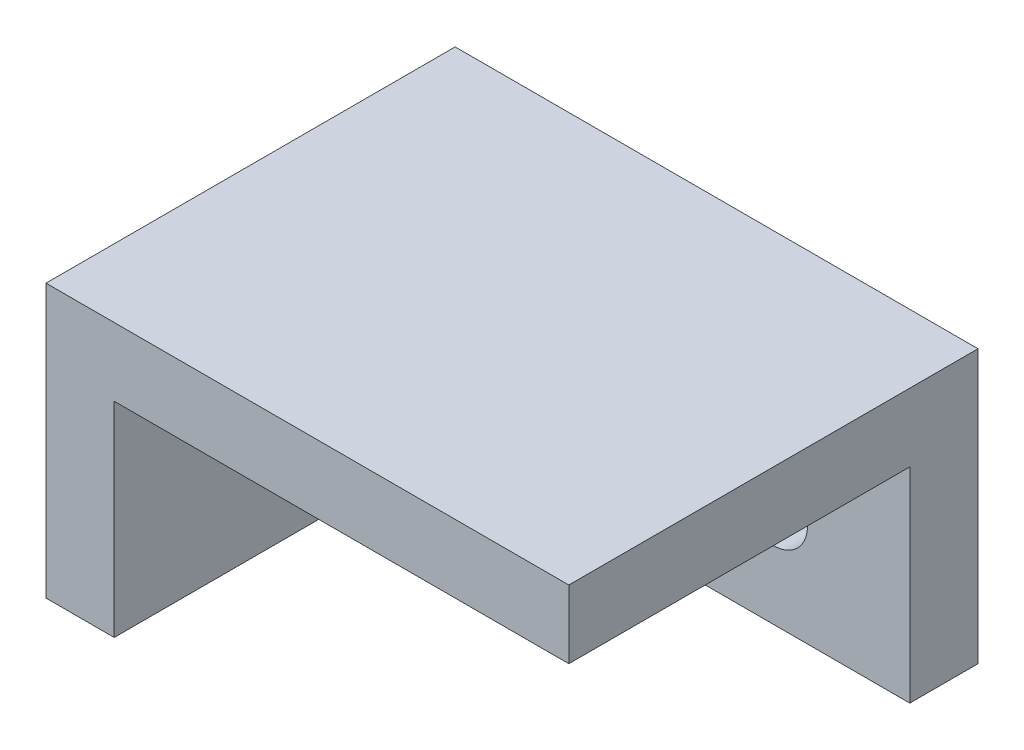
ISO-10303-21;
HEADER;
FILE_DESCRIPTION(('STEP AP214'),'2;1');
FILE_NAME('part.step','',(''),(''),'','','');
FILE_SCHEMA(('AUTOMOTIVE_DESIGN { 1 0 10303 214 1 1 1 1 }'));
ENDSEC;
DATA;
#1=APPLICATION_CONTEXT('core data for automotive mechanical design processes');
#2=APPLICATION_PROTOCOL_DEFINITION('international standard','automotive_design',2000,#1);
#3=PRODUCT_CONTEXT('',#1,'mechanical');
#4=PRODUCT('Part','Part','',(#3));
#5=PRODUCT_RELATED_PRODUCT_CATEGORY('part','',(#4));
#6=PRODUCT_DEFINITION_FORMATION('','',#4);
#7=PRODUCT_DEFINITION_CONTEXT('part definition',#1,'design');
#8=PRODUCT_DEFINITION('design','',#6,#7);
#9=PRODUCT_DEFINITION_SHAPE('','',#8);
#10=(LENGTH_UNIT() NAMED_UNIT(*) SI_UNIT(.MILLI.,.METRE.));
#11=(NAMED_UNIT(*) PLANE_ANGLE_UNIT() SI_UNIT($,.RADIAN.));
#12=(NAMED_UNIT(*) SI_UNIT($,.STERADIAN.) SOLID_ANGLE_UNIT());
#13=UNCERTAINTY_MEASURE_WITH_UNIT(LENGTH_MEASURE(1.E-05),#10,'distance_accuracy_value','');
#14=(GEOMETRIC_REPRESENTATION_CONTEXT(3) GLOBAL_UNCERTAINTY_ASSIGNED_CONTEXT((#13)) GLOBAL_UNIT_ASSIGNED_CONTEXT((#10,
#11,#12)) REPRESENTATION_CONTEXT('',''));
#15=CARTESIAN_POINT('',(0.,0.,0.));
#16=DIRECTION('',(0.,0.,1.));
#17=DIRECTION('',(1.,0.,0.));
#18=AXIS2_PLACEMENT_3D('',#15,#16,#17);
#19=CARTESIAN_POINT('',(-11.5,-6.,-18.));
#20=DIRECTION('',(0.,1.,0.));
#21=DIRECTION('',(0.,0.,-1.));
#22=AXIS2_PLACEMENT_3D('',#19,#20,#21);
#23=PLANE('',#22);
#24=DIRECTION('',(0.,0.,1.));
#25=VECTOR('',#24,1.);
#26=CARTESIAN_POINT('',(-11.5,-6.,-18.));
#27=LINE('',#26,#25);
#28=CARTESIAN_POINT('',(-11.5,-6.,-18.));
#29=VERTEX_POINT('',#28);
#30=CARTESIAN_POINT('',(-11.5,-6.,-15.));
#31=VERTEX_POINT('',#30);
#32=EDGE_CURVE('E123',#29,#31,#27,.T.);
#33=ORIENTED_EDGE('',*,*,#32,.F.);
#34=DIRECTION('',(1.,0.,0.));
#35=VECTOR('',#34,1.);
#36=CARTESIAN_POINT('',(-11.5,-6.,-18.));
#37=LINE('',#36,#35);
#38=CARTESIAN_POINT('',(11.5,-6.,-18.));
#39=VERTEX_POINT('',#38);
#40=EDGE_CURVE('E159',#29,#39,#37,.T.);
#41=ORIENTED_EDGE('',*,*,#40,.T.);
#42=DIRECTION('',(0.,0.,1.));
#43=VECTOR('',#42,1.);
#44=CARTESIAN_POINT('',(11.5,-6.,-18.));
#45=LINE('',#44,#43);
#46=CARTESIAN_POINT('',(11.5,-6.,-15.));
#47=VERTEX_POINT('',#46);
#48=EDGE_CURVE('E162',#39,#47,#45,.T.);
#49=ORIENTED_EDGE('',*,*,#48,.T.);
#50=DIRECTION('',(1.,0.,0.));
#51=VECTOR('',#50,1.);
#52=CARTESIAN_POINT('',(-8.5,-6.,-15.));
#53=LINE('',#52,#51);
#54=EDGE_CURVE('E113',#31,#47,#53,.T.);
#55=ORIENTED_EDGE('',*,*,#54,.F.);
#56=EDGE_LOOP('',(#33,#41,#49,#55));
#57=FACE_BOUND('',#56,.T.);
#58=ADVANCED_FACE('F35',(#57),#23,.F.);
#59=CARTESIAN_POINT('',(11.5,-6.,-18.));
#60=DIRECTION('',(-1.,0.,0.));
#61=DIRECTION('',(0.,0.,-1.));
#62=AXIS2_PLACEMENT_3D('',#59,#60,#61);
#63=PLANE('',#62);
#64=ORIENTED_EDGE('',*,*,#48,.F.);
#65=DIRECTION('',(0.,1.,0.));
#66=VECTOR('',#65,1.);
#67=CARTESIAN_POINT('',(11.5,-6.,-18.));
#68=LINE('',#67,#66);
#69=CARTESIAN_POINT('',(11.5,6.,-18.));
#70=VERTEX_POINT('',#69);
#71=EDGE_CURVE('E150',#39,#70,#68,.T.);
#72=ORIENTED_EDGE('',*,*,#71,.T.);
#73=DIRECTION('',(0.,0.,1.));
#74=VECTOR('',#73,1.);
#75=CARTESIAN_POINT('',(11.5,6.,-18.));
#76=LINE('',#75,#74);
#77=CARTESIAN_POINT('',(11.5,6.,0.));
#78=VERTEX_POINT('',#77);
#79=EDGE_CURVE('E43',#70,#78,#76,.T.);
#80=ORIENTED_EDGE('',*,*,#79,.T.);
#81=DIRECTION('',(0.,1.,0.));
#82=VECTOR('',#81,1.);
#83=CARTESIAN_POINT('',(11.5,-6.,0.));
#84=LINE('',#83,#82);
#85=CARTESIAN_POINT('',(11.5,3.,0.));
#86=VERTEX_POINT('',#85);
#87=EDGE_CURVE('E147',#86,#78,#84,.T.);
#88=ORIENTED_EDGE('',*,*,#87,.F.);
#89=DIRECTION('',(0.,0.,-1.));
#90=VECTOR('',#89,1.);
#91=CARTESIAN_POINT('',(11.5,3.,0.));
#92=LINE('',#91,#90);
#93=CARTESIAN_POINT('',(11.5,3.,-15.));
#94=VERTEX_POINT('',#93);
#95=EDGE_CURVE('E137',#86,#94,#92,.T.);
#96=ORIENTED_EDGE('',*,*,#95,.T.);
#97=DIRECTION('',(0.,-1.,0.));
#98=VECTOR('',#97,1.);
#99=CARTESIAN_POINT('',(11.5,-6.,-15.));
#100=LINE('',#99,#98);
#101=EDGE_CURVE('E108',#94,#47,#100,.T.);
#102=ORIENTED_EDGE('',*,*,#101,.T.);
#103=EDGE_LOOP('',(#64,#72,#80,#88,#96,#102));
#104=FACE_BOUND('',#103,.T.);
#105=ADVANCED_FACE('F37',(#104),#63,.F.);
#106=CARTESIAN_POINT('',(-11.5,6.,-18.));
#107=DIRECTION('',(0.,-1.,0.));
#108=DIRECTION('',(0.,0.,1.));
#109=AXIS2_PLACEMENT_3D('',#106,#107,#108);
#110=PLANE('',#109);
#111=DIRECTION('',(-1.,0.,0.));
#112=VECTOR('',#111,1.);
#113=CARTESIAN_POINT('',(-11.5,6.,0.));
#114=LINE('',#113,#112);
#115=CARTESIAN_POINT('',(-11.5,6.,0.));
#116=VERTEX_POINT('',#115);
#117=EDGE_CURVE('E165',#78,#116,#114,.T.);
#118=ORIENTED_EDGE('',*,*,#117,.F.);
#119=ORIENTED_EDGE('',*,*,#79,.F.);
#120=DIRECTION('',(-1.,0.,0.));
#121=VECTOR('',#120,1.);
#122=CARTESIAN_POINT('',(-11.5,6.,-18.));
#123=LINE('',#122,#121);
#124=CARTESIAN_POINT('',(-11.5,6.,-18.));
#125=VERTEX_POINT('',#124);
#126=EDGE_CURVE('E153',#70,#125,#123,.T.);
#127=ORIENTED_EDGE('',*,*,#126,.T.);
#128=DIRECTION('',(0.,0.,1.));
#129=VECTOR('',#128,1.);
#130=CARTESIAN_POINT('',(-11.5,6.,-18.));
#131=LINE('',#130,#129);
#132=EDGE_CURVE('E176',#125,#116,#131,.T.);
#133=ORIENTED_EDGE('',*,*,#132,.T.);
#134=EDGE_LOOP('',(#118,#119,#127,#133));
#135=FACE_BOUND('',#134,.T.);
#136=ADVANCED_FACE('F184',(#135),#110,.F.);
#137=CARTESIAN_POINT('',(-11.5,-6.,-18.));
#138=DIRECTION('',(1.,0.,0.));
#139=DIRECTION('',(0.,0.,1.));
#140=AXIS2_PLACEMENT_3D('',#137,#138,#139);
#141=PLANE('',#140);
#142=DIRECTION('',(0.,0.,1.));
#143=VECTOR('',#142,1.);
#144=CARTESIAN_POINT('',(-11.5,3.,-15.));
#145=LINE('',#144,#143);
#146=CARTESIAN_POINT('',(-11.5,3.,-15.));
#147=VERTEX_POINT('',#146);
#148=CARTESIAN_POINT('',(-11.5,3.,-13.9));
#149=VERTEX_POINT('',#148);
#150=EDGE_CURVE('E121',#147,#149,#145,.T.);
#151=ORIENTED_EDGE('',*,*,#150,.T.);
#152=DIRECTION('',(0.,-1.,0.));
#153=VECTOR('',#152,1.);
#154=CARTESIAN_POINT('',(-11.5,-6.,-13.9));
#155=LINE('',#154,#153);
#156=CARTESIAN_POINT('',(-11.5,-6.,-13.9));
#157=VERTEX_POINT('',#156);
#158=EDGE_CURVE('E130',#149,#157,#155,.T.);
#159=ORIENTED_EDGE('',*,*,#158,.T.);
#160=CARTESIAN_POINT('',(-11.5,-6.,0.));
#161=VERTEX_POINT('',#160);
#162=EDGE_CURVE('E174',#157,#161,#27,.T.);
#163=ORIENTED_EDGE('',*,*,#162,.T.);
#164=DIRECTION('',(0.,-1.,0.));
#165=VECTOR('',#164,1.);
#166=CARTESIAN_POINT('',(-11.5,-6.,0.));
#167=LINE('',#166,#165);
#168=EDGE_CURVE('E168',#116,#161,#167,.T.);
#169=ORIENTED_EDGE('',*,*,#168,.F.);
#170=ORIENTED_EDGE('',*,*,#132,.F.);
#171=DIRECTION('',(0.,-1.,0.));
#172=VECTOR('',#171,1.);
#173=CARTESIAN_POINT('',(-11.5,-6.,-18.));
#174=LINE('',#173,#172);
#175=EDGE_CURVE('E157',#125,#29,#174,.T.);
#176=ORIENTED_EDGE('',*,*,#175,.T.);
#177=ORIENTED_EDGE('',*,*,#32,.T.);
#178=DIRECTION('',(0.,1.,0.));
#179=VECTOR('',#178,1.);
#180=CARTESIAN_POINT('',(-11.5,-6.,-15.));
#181=LINE('',#180,#179);
#182=EDGE_CURVE('E106',#31,#147,#181,.T.);
#183=ORIENTED_EDGE('',*,*,#182,.T.);
#184=EDGE_LOOP('',(#151,#159,#163,#169,#170,#176,#177,#183));
#185=FACE_BOUND('',#184,.T.);
#186=ADVANCED_FACE('F119',(#185),#141,.F.);
#187=DIRECTION('',(0.,0.,1.));
#188=VECTOR('',#187,1.);
#189=CARTESIAN_POINT('',(-8.5,-6.,0.));
#190=LINE('',#189,#188);
#191=CARTESIAN_POINT('',(-8.5,-6.,-13.9));
#192=VERTEX_POINT('',#191);
#193=CARTESIAN_POINT('',(-8.5,-6.,0.));
#194=VERTEX_POINT('',#193);
#195=EDGE_CURVE('E142',#192,#194,#190,.T.);
#196=ORIENTED_EDGE('',*,*,#195,.T.);
#197=DIRECTION('',(1.,0.,0.));
#198=VECTOR('',#197,1.);
#199=CARTESIAN_POINT('',(-11.5,-6.,0.));
#200=LINE('',#199,#198);
#201=EDGE_CURVE('E154',#161,#194,#200,.T.);
#202=ORIENTED_EDGE('',*,*,#201,.F.);
#203=ORIENTED_EDGE('',*,*,#162,.F.);
#204=DIRECTION('',(-1.,0.,0.));
#205=VECTOR('',#204,1.);
#206=CARTESIAN_POINT('',(11.5,-6.,-13.9));
#207=LINE('',#206,#205);
#208=EDGE_CURVE('E135',#192,#157,#207,.T.);
#209=ORIENTED_EDGE('',*,*,#208,.F.);
#210=EDGE_LOOP('',(#196,#202,#203,#209));
#211=FACE_BOUND('',#210,.T.);
#212=ADVANCED_FACE('F197',(#211),#23,.F.);
#213=CARTESIAN_POINT('',(0.,0.,-18.));
#214=DIRECTION('',(0.,0.,1.));
#215=DIRECTION('',(-1.,0.,0.));
#216=AXIS2_PLACEMENT_3D('',#213,#214,#215);
#217=PLANE('',#216);
#218=CARTESIAN_POINT('',(-3.5,-1.5,-18.));
#219=DIRECTION('',(0.,0.,-1.));
#220=DIRECTION('',(-1.,0.,0.));
#221=AXIS2_PLACEMENT_3D('',#218,#219,#220);
#222=CIRCLE('',#221,1.5);
#223=CARTESIAN_POINT('',(-5.,-1.5,-18.));
#224=VERTEX_POINT('',#223);
#225=EDGE_CURVE('E313',#224,#224,#222,.T.);
#226=ORIENTED_EDGE('',*,*,#225,.F.);
#227=EDGE_LOOP('',(#226));
#228=FACE_BOUND('',#227,.T.);
#229=CARTESIAN_POINT('',(5.5,-1.5,-18.));
#230=DIRECTION('',(0.,0.,-1.));
#231=DIRECTION('',(-1.,0.,0.));
#232=AXIS2_PLACEMENT_3D('',#229,#230,#231);
#233=CIRCLE('',#232,1.5);
#234=CARTESIAN_POINT('',(4.,-1.5,-18.));
#235=VERTEX_POINT('',#234);
#236=EDGE_CURVE('E124',#235,#235,#233,.T.);
#237=ORIENTED_EDGE('',*,*,#236,.F.);
#238=EDGE_LOOP('',(#237));
#239=FACE_BOUND('',#238,.T.);
#240=ORIENTED_EDGE('',*,*,#71,.F.);
#241=ORIENTED_EDGE('',*,*,#40,.F.);
#242=ORIENTED_EDGE('',*,*,#175,.F.);
#243=ORIENTED_EDGE('',*,*,#126,.F.);
#244=EDGE_LOOP('',(#240,#241,#242,#243));
#245=FACE_BOUND('',#244,.T.);
#246=ADVANCED_FACE('F192',(#228,#239,#245),#217,.F.);
#247=CARTESIAN_POINT('',(0.,0.,0.));
#248=DIRECTION('',(0.,0.,1.));
#249=DIRECTION('',(-1.,0.,0.));
#250=AXIS2_PLACEMENT_3D('',#247,#248,#249);
#251=PLANE('',#250);
#252=DIRECTION('',(1.,0.,0.));
#253=VECTOR('',#252,1.);
#254=CARTESIAN_POINT('',(-8.5,3.,0.));
#255=LINE('',#254,#253);
#256=CARTESIAN_POINT('',(-8.5,3.,0.));
#257=VERTEX_POINT('',#256);
#258=EDGE_CURVE('E114',#257,#86,#255,.T.);
#259=ORIENTED_EDGE('',*,*,#258,.T.);
#260=ORIENTED_EDGE('',*,*,#87,.T.);
#261=ORIENTED_EDGE('',*,*,#117,.T.);
#262=ORIENTED_EDGE('',*,*,#168,.T.);
#263=ORIENTED_EDGE('',*,*,#201,.T.);
#264=DIRECTION('',(0.,1.,0.));
#265=VECTOR('',#264,1.);
#266=CARTESIAN_POINT('',(-8.5,-6.,0.));
#267=LINE('',#266,#265);
#268=EDGE_CURVE('E53',#194,#257,#267,.T.);
#269=ORIENTED_EDGE('',*,*,#268,.T.);
#270=EDGE_LOOP('',(#259,#260,#261,#262,#263,#269));
#271=FACE_BOUND('',#270,.T.);
#272=ADVANCED_FACE('F187',(#271),#251,.T.);
#273=CARTESIAN_POINT('',(-8.5,-6.,-15.));
#274=DIRECTION('',(0.,0.,-1.));
#275=DIRECTION('',(1.,0.,0.));
#276=AXIS2_PLACEMENT_3D('',#273,#274,#275);
#277=PLANE('',#276);
#278=CARTESIAN_POINT('',(-3.5,-1.5,-15.));
#279=DIRECTION('',(0.,0.,-1.));
#280=DIRECTION('',(-1.,0.,0.));
#281=AXIS2_PLACEMENT_3D('',#278,#279,#280);
#282=CIRCLE('',#281,1.5);
#283=CARTESIAN_POINT('',(-5.,-1.5,-15.));
#284=VERTEX_POINT('',#283);
#285=EDGE_CURVE('E316',#284,#284,#282,.T.);
#286=ORIENTED_EDGE('',*,*,#285,.T.);
#287=EDGE_LOOP('',(#286));
#288=FACE_BOUND('',#287,.T.);
#289=CARTESIAN_POINT('',(5.5,-1.5,-15.));
#290=DIRECTION('',(0.,0.,-1.));
#291=DIRECTION('',(-1.,0.,0.));
#292=AXIS2_PLACEMENT_3D('',#289,#290,#291);
#293=CIRCLE('',#292,1.5);
#294=CARTESIAN_POINT('',(4.,-1.5,-15.));
#295=VERTEX_POINT('',#294);
#296=EDGE_CURVE('E318',#295,#295,#293,.T.);
#297=ORIENTED_EDGE('',*,*,#296,.T.);
#298=EDGE_LOOP('',(#297));
#299=FACE_BOUND('',#298,.T.);
#300=ORIENTED_EDGE('',*,*,#101,.F.);
#301=DIRECTION('',(1.,0.,0.));
#302=VECTOR('',#301,1.);
#303=CARTESIAN_POINT('',(-8.5,3.,-15.));
#304=LINE('',#303,#302);
#305=EDGE_CURVE('E102',#147,#94,#304,.T.);
#306=ORIENTED_EDGE('',*,*,#305,.F.);
#307=ORIENTED_EDGE('',*,*,#182,.F.);
#308=ORIENTED_EDGE('',*,*,#54,.T.);
#309=EDGE_LOOP('',(#300,#306,#307,#308));
#310=FACE_BOUND('',#309,.T.);
#311=ADVANCED_FACE('F104',(#288,#299,#310),#277,.F.);
#312=CARTESIAN_POINT('',(-8.5,3.,0.));
#313=DIRECTION('',(0.,1.,0.));
#314=DIRECTION('',(0.,0.,-1.));
#315=AXIS2_PLACEMENT_3D('',#312,#313,#314);
#316=PLANE('',#315);
#317=ORIENTED_EDGE('',*,*,#95,.F.);
#318=ORIENTED_EDGE('',*,*,#258,.F.);
#319=DIRECTION('',(0.,0.,-1.));
#320=VECTOR('',#319,1.);
#321=CARTESIAN_POINT('',(-8.5,3.,0.));
#322=LINE('',#321,#320);
#323=CARTESIAN_POINT('',(-8.5,3.,-13.9));
#324=VERTEX_POINT('',#323);
#325=EDGE_CURVE('E140',#257,#324,#322,.T.);
#326=ORIENTED_EDGE('',*,*,#325,.T.);
#327=DIRECTION('',(-1.,0.,0.));
#328=VECTOR('',#327,1.);
#329=CARTESIAN_POINT('',(11.5,3.,-13.9));
#330=LINE('',#329,#328);
#331=EDGE_CURVE('E128',#324,#149,#330,.T.);
#332=ORIENTED_EDGE('',*,*,#331,.T.);
#333=ORIENTED_EDGE('',*,*,#150,.F.);
#334=ORIENTED_EDGE('',*,*,#305,.T.);
#335=EDGE_LOOP('',(#317,#318,#326,#332,#333,#334));
#336=FACE_BOUND('',#335,.T.);
#337=ADVANCED_FACE('F126',(#336),#316,.F.);
#338=CARTESIAN_POINT('',(-8.5,0.,0.));
#339=DIRECTION('',(1.,0.,0.));
#340=DIRECTION('',(0.,0.,1.));
#341=AXIS2_PLACEMENT_3D('',#338,#339,#340);
#342=PLANE('',#341);
#343=DIRECTION('',(0.,1.,0.));
#344=VECTOR('',#343,1.);
#345=CARTESIAN_POINT('',(-8.5,0.,-13.9));
#346=LINE('',#345,#344);
#347=EDGE_CURVE('E11',#192,#324,#346,.T.);
#348=ORIENTED_EDGE('',*,*,#347,.T.);
#349=ORIENTED_EDGE('',*,*,#325,.F.);
#350=ORIENTED_EDGE('',*,*,#268,.F.);
#351=ORIENTED_EDGE('',*,*,#195,.F.);
#352=EDGE_LOOP('',(#348,#349,#350,#351));
#353=FACE_BOUND('',#352,.T.);
#354=ADVANCED_FACE('F198',(#353),#342,.T.);
#355=CARTESIAN_POINT('',(11.5,-6.,-13.9));
#356=DIRECTION('',(0.,0.,1.));
#357=DIRECTION('',(0.,1.,0.));
#358=AXIS2_PLACEMENT_3D('',#355,#356,#357);
#359=PLANE('',#358);
#360=ORIENTED_EDGE('',*,*,#347,.F.);
#361=ORIENTED_EDGE('',*,*,#208,.T.);
#362=ORIENTED_EDGE('',*,*,#158,.F.);
#363=ORIENTED_EDGE('',*,*,#331,.F.);
#364=EDGE_LOOP('',(#360,#361,#362,#363));
#365=FACE_BOUND('',#364,.T.);
#366=ADVANCED_FACE('F200',(#365),#359,.F.);
#367=CARTESIAN_POINT('',(5.5,-1.5,-18.));
#368=DIRECTION('',(0.,0.,1.));
#369=DIRECTION('',(-1.,0.,0.));
#370=AXIS2_PLACEMENT_3D('',#367,#368,#369);
#371=CYLINDRICAL_SURFACE('',#370,1.5);
#372=ORIENTED_EDGE('',*,*,#236,.T.);
#373=EDGE_LOOP('',(#372));
#374=FACE_BOUND('',#373,.T.);
#375=ORIENTED_EDGE('',*,*,#296,.F.);
#376=EDGE_LOOP('',(#375));
#377=FACE_BOUND('',#376,.T.);
#378=ADVANCED_FACE('F206',(#374,#377),#371,.F.);
#379=CARTESIAN_POINT('',(-3.5,-1.5,-18.));
#380=DIRECTION('',(0.,0.,1.));
#381=DIRECTION('',(-1.,0.,0.));
#382=AXIS2_PLACEMENT_3D('',#379,#380,#381);
#383=CYLINDRICAL_SURFACE('',#382,1.5);
#384=ORIENTED_EDGE('',*,*,#225,.T.);
#385=EDGE_LOOP('',(#384));
#386=FACE_BOUND('',#385,.T.);
#387=ORIENTED_EDGE('',*,*,#285,.F.);
#388=EDGE_LOOP('',(#387));
#389=FACE_BOUND('',#388,.T.);
#390=ADVANCED_FACE('F296',(#386,#389),#383,.F.);
#391=CLOSED_SHELL('',(#58,#105,#136,#186,#212,#246,#272,#311,#337,#354,#366,#378,#390));
#392=MANIFOLD_SOLID_BREP('B2',#391);
#393=ADVANCED_BREP_SHAPE_REPRESENTATION('',(#18,#392),#14);
#394=SHAPE_DEFINITION_REPRESENTATION(#9,#393);
ENDSEC;
END-ISO-10303-21;
